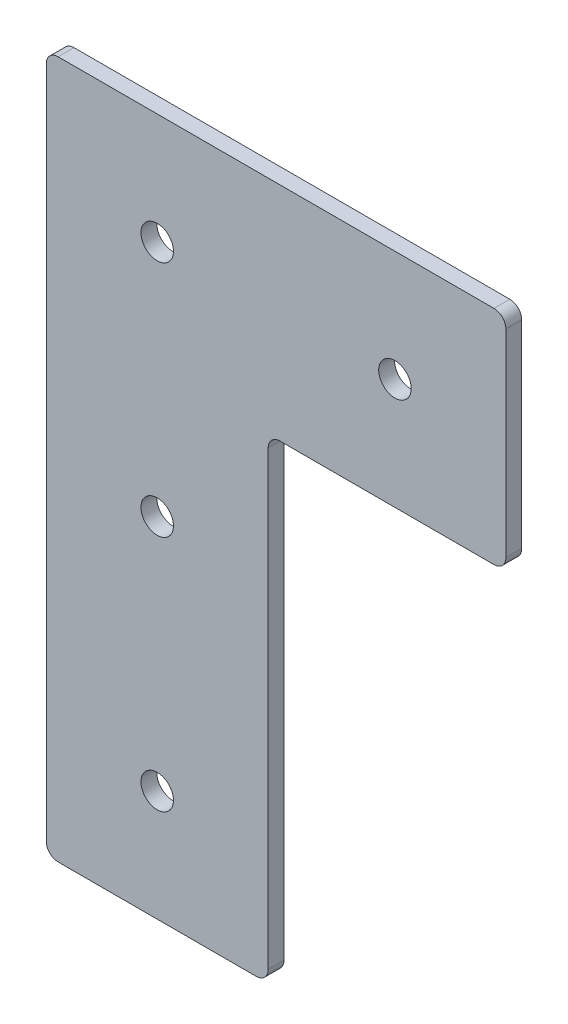
ISO-10303-21;
HEADER;
FILE_DESCRIPTION(('STEP AP214'),'2;1');
FILE_NAME('part.step','',(''),(''),'','','');
FILE_SCHEMA(('AUTOMOTIVE_DESIGN { 1 0 10303 214 1 1 1 1 }'));
ENDSEC;
DATA;
#1=APPLICATION_CONTEXT('core data for automotive mechanical design processes');
#2=APPLICATION_PROTOCOL_DEFINITION('international standard','automotive_design',2000,#1);
#3=PRODUCT_CONTEXT('',#1,'mechanical');
#4=PRODUCT('Part','Part','',(#3));
#5=PRODUCT_RELATED_PRODUCT_CATEGORY('part','',(#4));
#6=PRODUCT_DEFINITION_FORMATION('','',#4);
#7=PRODUCT_DEFINITION_CONTEXT('part definition',#1,'design');
#8=PRODUCT_DEFINITION('design','',#6,#7);
#9=PRODUCT_DEFINITION_SHAPE('','',#8);
#10=(LENGTH_UNIT() NAMED_UNIT(*) SI_UNIT(.MILLI.,.METRE.));
#11=(NAMED_UNIT(*) PLANE_ANGLE_UNIT() SI_UNIT($,.RADIAN.));
#12=(NAMED_UNIT(*) SI_UNIT($,.STERADIAN.) SOLID_ANGLE_UNIT());
#13=UNCERTAINTY_MEASURE_WITH_UNIT(LENGTH_MEASURE(1.E-05),#10,'distance_accuracy_value','');
#14=(GEOMETRIC_REPRESENTATION_CONTEXT(3) GLOBAL_UNCERTAINTY_ASSIGNED_CONTEXT((#13)) GLOBAL_UNIT_ASSIGNED_CONTEXT((#10,
#11,#12)) REPRESENTATION_CONTEXT('',''));
#15=CARTESIAN_POINT('',(0.,0.,0.));
#16=DIRECTION('',(0.,0.,1.));
#17=DIRECTION('',(1.,0.,0.));
#18=AXIS2_PLACEMENT_3D('',#15,#16,#17);
#19=CARTESIAN_POINT('',(0.,0.,4.));
#20=DIRECTION('',(0.,0.,1.));
#21=DIRECTION('',(1.,0.,0.));
#22=AXIS2_PLACEMENT_3D('',#19,#20,#21);
#23=PLANE('',#22);
#24=CARTESIAN_POINT('',(6.24792700594322E-13,-60.,4.));
#25=DIRECTION('',(0.,0.,1.));
#26=DIRECTION('',(1.,0.,0.));
#27=AXIS2_PLACEMENT_3D('',#24,#25,#26);
#28=CIRCLE('',#27,4.1);
#29=CARTESIAN_POINT('',(4.10000000000062,-60.,4.));
#30=VERTEX_POINT('',#29);
#31=EDGE_CURVE('E225',#30,#30,#28,.T.);
#32=ORIENTED_EDGE('',*,*,#31,.F.);
#33=EDGE_LOOP('',(#32));
#34=FACE_BOUND('',#33,.T.);
#35=CARTESIAN_POINT('',(0.,0.,4.));
#36=DIRECTION('',(0.,0.,1.));
#37=DIRECTION('',(1.,0.,0.));
#38=AXIS2_PLACEMENT_3D('',#35,#36,#37);
#39=CIRCLE('',#38,4.1);
#40=CARTESIAN_POINT('',(4.1,0.,4.));
#41=VERTEX_POINT('',#40);
#42=EDGE_CURVE('E133',#41,#41,#39,.T.);
#43=ORIENTED_EDGE('',*,*,#42,.F.);
#44=EDGE_LOOP('',(#43));
#45=FACE_BOUND('',#44,.T.);
#46=DIRECTION('',(-1.,0.,0.));
#47=VECTOR('',#46,1.);
#48=CARTESIAN_POINT('',(-28.,28.,4.));
#49=LINE('',#48,#47);
#50=CARTESIAN_POINT('',(85.,28.,4.));
#51=VERTEX_POINT('',#50);
#52=CARTESIAN_POINT('',(-25.,28.,4.));
#53=VERTEX_POINT('',#52);
#54=EDGE_CURVE('E142',#51,#53,#49,.T.);
#55=ORIENTED_EDGE('',*,*,#54,.T.);
#56=CARTESIAN_POINT('',(-25.,25.,4.));
#57=DIRECTION('',(0.,0.,1.));
#58=DIRECTION('',(1.,0.,0.));
#59=AXIS2_PLACEMENT_3D('',#56,#57,#58);
#60=CIRCLE('',#59,3.);
#61=CARTESIAN_POINT('',(-28.,25.,4.));
#62=VERTEX_POINT('',#61);
#63=EDGE_CURVE('E171',#53,#62,#60,.T.);
#64=ORIENTED_EDGE('',*,*,#63,.T.);
#65=DIRECTION('',(0.,-1.,0.));
#66=VECTOR('',#65,1.);
#67=CARTESIAN_POINT('',(-28.,28.,4.));
#68=LINE('',#67,#66);
#69=CARTESIAN_POINT('',(-28.,-145.,4.));
#70=VERTEX_POINT('',#69);
#71=EDGE_CURVE('E125',#62,#70,#68,.T.);
#72=ORIENTED_EDGE('',*,*,#71,.T.);
#73=CARTESIAN_POINT('',(-25.,-145.,4.));
#74=DIRECTION('',(0.,0.,1.));
#75=DIRECTION('',(1.,0.,0.));
#76=AXIS2_PLACEMENT_3D('',#73,#74,#75);
#77=CIRCLE('',#76,3.);
#78=CARTESIAN_POINT('',(-25.,-148.,4.));
#79=VERTEX_POINT('',#78);
#80=EDGE_CURVE('E169',#70,#79,#77,.T.);
#81=ORIENTED_EDGE('',*,*,#80,.T.);
#82=DIRECTION('',(1.,0.,0.));
#83=VECTOR('',#82,1.);
#84=CARTESIAN_POINT('',(-28.,-148.,4.));
#85=LINE('',#84,#83);
#86=CARTESIAN_POINT('',(25.,-148.,4.));
#87=VERTEX_POINT('',#86);
#88=EDGE_CURVE('E213',#79,#87,#85,.T.);
#89=ORIENTED_EDGE('',*,*,#88,.T.);
#90=CARTESIAN_POINT('',(25.,-145.,4.));
#91=DIRECTION('',(0.,0.,1.));
#92=DIRECTION('',(1.,0.,0.));
#93=AXIS2_PLACEMENT_3D('',#90,#91,#92);
#94=CIRCLE('',#93,3.);
#95=CARTESIAN_POINT('',(28.,-145.,4.));
#96=VERTEX_POINT('',#95);
#97=EDGE_CURVE('E167',#87,#96,#94,.T.);
#98=ORIENTED_EDGE('',*,*,#97,.T.);
#99=DIRECTION('',(0.,1.,0.));
#100=VECTOR('',#99,1.);
#101=CARTESIAN_POINT('',(28.,-28.,4.));
#102=LINE('',#101,#100);
#103=CARTESIAN_POINT('',(28.,-31.,4.));
#104=VERTEX_POINT('',#103);
#105=EDGE_CURVE('E207',#96,#104,#102,.T.);
#106=ORIENTED_EDGE('',*,*,#105,.T.);
#107=CARTESIAN_POINT('',(31.,-31.,4.));
#108=DIRECTION('',(0.,0.,1.));
#109=DIRECTION('',(1.,0.,0.));
#110=AXIS2_PLACEMENT_3D('',#107,#108,#109);
#111=CIRCLE('',#110,3.);
#112=CARTESIAN_POINT('',(31.,-28.,4.));
#113=VERTEX_POINT('',#112);
#114=EDGE_CURVE('E9',#104,#113,#111,.F.);
#115=ORIENTED_EDGE('',*,*,#114,.T.);
#116=DIRECTION('',(1.,0.,0.));
#117=VECTOR('',#116,1.);
#118=CARTESIAN_POINT('',(28.,-28.,4.));
#119=LINE('',#118,#117);
#120=CARTESIAN_POINT('',(85.,-28.,4.));
#121=VERTEX_POINT('',#120);
#122=EDGE_CURVE('E206',#113,#121,#119,.T.);
#123=ORIENTED_EDGE('',*,*,#122,.T.);
#124=CARTESIAN_POINT('',(85.,-25.,4.));
#125=DIRECTION('',(0.,0.,1.));
#126=DIRECTION('',(1.,0.,0.));
#127=AXIS2_PLACEMENT_3D('',#124,#125,#126);
#128=CIRCLE('',#127,3.);
#129=CARTESIAN_POINT('',(88.,-25.,4.));
#130=VERTEX_POINT('',#129);
#131=EDGE_CURVE('E37',#121,#130,#128,.T.);
#132=ORIENTED_EDGE('',*,*,#131,.T.);
#133=DIRECTION('',(0.,1.,0.));
#134=VECTOR('',#133,1.);
#135=CARTESIAN_POINT('',(88.,28.,4.));
#136=LINE('',#135,#134);
#137=CARTESIAN_POINT('',(88.,25.,4.));
#138=VERTEX_POINT('',#137);
#139=EDGE_CURVE('E211',#130,#138,#136,.T.);
#140=ORIENTED_EDGE('',*,*,#139,.T.);
#141=CARTESIAN_POINT('',(85.,25.,4.));
#142=DIRECTION('',(0.,0.,1.));
#143=DIRECTION('',(1.,0.,0.));
#144=AXIS2_PLACEMENT_3D('',#141,#142,#143);
#145=CIRCLE('',#144,3.);
#146=EDGE_CURVE('E165',#138,#51,#145,.T.);
#147=ORIENTED_EDGE('',*,*,#146,.T.);
#148=EDGE_LOOP('',(#55,#64,#72,#81,#89,#98,#106,#115,#123,#132,#140,#147));
#149=FACE_BOUND('',#148,.T.);
#150=CARTESIAN_POINT('',(60.,0.,4.));
#151=DIRECTION('',(0.,0.,1.));
#152=DIRECTION('',(1.,0.,0.));
#153=AXIS2_PLACEMENT_3D('',#150,#151,#152);
#154=CIRCLE('',#153,4.09999999999999);
#155=CARTESIAN_POINT('',(64.1,0.,4.));
#156=VERTEX_POINT('',#155);
#157=EDGE_CURVE('E220',#156,#156,#154,.T.);
#158=ORIENTED_EDGE('',*,*,#157,.F.);
#159=EDGE_LOOP('',(#158));
#160=FACE_BOUND('',#159,.T.);
#161=CARTESIAN_POINT('',(1.24958540118864E-12,-120.,4.));
#162=DIRECTION('',(0.,0.,1.));
#163=DIRECTION('',(1.,0.,0.));
#164=AXIS2_PLACEMENT_3D('',#161,#162,#163);
#165=CIRCLE('',#164,4.1);
#166=CARTESIAN_POINT('',(4.10000000000125,-120.,4.));
#167=VERTEX_POINT('',#166);
#168=EDGE_CURVE('E231',#167,#167,#165,.T.);
#169=ORIENTED_EDGE('',*,*,#168,.F.);
#170=EDGE_LOOP('',(#169));
#171=FACE_BOUND('',#170,.T.);
#172=ADVANCED_FACE('F15',(#34,#45,#149,#160,#171),#23,.T.);
#173=CARTESIAN_POINT('',(0.,0.,0.));
#174=DIRECTION('',(0.,0.,1.));
#175=DIRECTION('',(1.,0.,0.));
#176=AXIS2_PLACEMENT_3D('',#173,#174,#175);
#177=PLANE('',#176);
#178=DIRECTION('',(0.,-1.,0.));
#179=VECTOR('',#178,1.);
#180=CARTESIAN_POINT('',(-28.,-28.,0.));
#181=LINE('',#180,#179);
#182=CARTESIAN_POINT('',(-28.,25.,0.));
#183=VERTEX_POINT('',#182);
#184=CARTESIAN_POINT('',(-28.,-145.,0.));
#185=VERTEX_POINT('',#184);
#186=EDGE_CURVE('E122',#183,#185,#181,.T.);
#187=ORIENTED_EDGE('',*,*,#186,.F.);
#188=CARTESIAN_POINT('',(-25.,25.,0.));
#189=DIRECTION('',(0.,0.,1.));
#190=DIRECTION('',(1.,0.,0.));
#191=AXIS2_PLACEMENT_3D('',#188,#189,#190);
#192=CIRCLE('',#191,3.);
#193=CARTESIAN_POINT('',(-25.,28.,0.));
#194=VERTEX_POINT('',#193);
#195=EDGE_CURVE('E105',#183,#194,#192,.F.);
#196=ORIENTED_EDGE('',*,*,#195,.T.);
#197=DIRECTION('',(-1.,0.,0.));
#198=VECTOR('',#197,1.);
#199=CARTESIAN_POINT('',(-28.,28.,0.));
#200=LINE('',#199,#198);
#201=CARTESIAN_POINT('',(85.,28.,0.));
#202=VERTEX_POINT('',#201);
#203=EDGE_CURVE('E152',#202,#194,#200,.T.);
#204=ORIENTED_EDGE('',*,*,#203,.F.);
#205=CARTESIAN_POINT('',(85.,25.,0.));
#206=DIRECTION('',(0.,0.,1.));
#207=DIRECTION('',(1.,0.,0.));
#208=AXIS2_PLACEMENT_3D('',#205,#206,#207);
#209=CIRCLE('',#208,3.);
#210=CARTESIAN_POINT('',(88.,25.,0.));
#211=VERTEX_POINT('',#210);
#212=EDGE_CURVE('E156',#202,#211,#209,.F.);
#213=ORIENTED_EDGE('',*,*,#212,.T.);
#214=DIRECTION('',(0.,1.,0.));
#215=VECTOR('',#214,1.);
#216=CARTESIAN_POINT('',(88.,28.,0.));
#217=LINE('',#216,#215);
#218=CARTESIAN_POINT('',(88.,-25.,0.));
#219=VERTEX_POINT('',#218);
#220=EDGE_CURVE('E150',#219,#211,#217,.T.);
#221=ORIENTED_EDGE('',*,*,#220,.F.);
#222=CARTESIAN_POINT('',(85.,-25.,0.));
#223=DIRECTION('',(0.,0.,1.));
#224=DIRECTION('',(1.,0.,0.));
#225=AXIS2_PLACEMENT_3D('',#222,#223,#224);
#226=CIRCLE('',#225,3.);
#227=CARTESIAN_POINT('',(85.,-28.,0.));
#228=VERTEX_POINT('',#227);
#229=EDGE_CURVE('E126',#219,#228,#226,.F.);
#230=ORIENTED_EDGE('',*,*,#229,.T.);
#231=DIRECTION('',(1.,0.,0.));
#232=VECTOR('',#231,1.);
#233=CARTESIAN_POINT('',(28.,-28.,0.));
#234=LINE('',#233,#232);
#235=CARTESIAN_POINT('',(31.,-28.,0.));
#236=VERTEX_POINT('',#235);
#237=EDGE_CURVE('E147',#236,#228,#234,.T.);
#238=ORIENTED_EDGE('',*,*,#237,.F.);
#239=CARTESIAN_POINT('',(31.,-31.,0.));
#240=DIRECTION('',(0.,0.,1.));
#241=DIRECTION('',(1.,0.,0.));
#242=AXIS2_PLACEMENT_3D('',#239,#240,#241);
#243=CIRCLE('',#242,3.);
#244=CARTESIAN_POINT('',(28.,-31.,0.));
#245=VERTEX_POINT('',#244);
#246=EDGE_CURVE('E23',#236,#245,#243,.T.);
#247=ORIENTED_EDGE('',*,*,#246,.T.);
#248=DIRECTION('',(0.,1.,0.));
#249=VECTOR('',#248,1.);
#250=CARTESIAN_POINT('',(28.,-28.,0.));
#251=LINE('',#250,#249);
#252=CARTESIAN_POINT('',(28.,-145.,0.));
#253=VERTEX_POINT('',#252);
#254=EDGE_CURVE('E136',#253,#245,#251,.T.);
#255=ORIENTED_EDGE('',*,*,#254,.F.);
#256=CARTESIAN_POINT('',(25.,-145.,0.));
#257=DIRECTION('',(0.,0.,1.));
#258=DIRECTION('',(1.,0.,0.));
#259=AXIS2_PLACEMENT_3D('',#256,#257,#258);
#260=CIRCLE('',#259,3.);
#261=CARTESIAN_POINT('',(25.,-148.,0.));
#262=VERTEX_POINT('',#261);
#263=EDGE_CURVE('E158',#253,#262,#260,.F.);
#264=ORIENTED_EDGE('',*,*,#263,.T.);
#265=DIRECTION('',(1.,0.,0.));
#266=VECTOR('',#265,1.);
#267=CARTESIAN_POINT('',(-28.,-148.,0.));
#268=LINE('',#267,#266);
#269=CARTESIAN_POINT('',(-25.,-148.,0.));
#270=VERTEX_POINT('',#269);
#271=EDGE_CURVE('E132',#270,#262,#268,.T.);
#272=ORIENTED_EDGE('',*,*,#271,.F.);
#273=CARTESIAN_POINT('',(-25.,-145.,0.));
#274=DIRECTION('',(0.,0.,1.));
#275=DIRECTION('',(1.,0.,0.));
#276=AXIS2_PLACEMENT_3D('',#273,#274,#275);
#277=CIRCLE('',#276,3.);
#278=EDGE_CURVE('E116',#270,#185,#277,.F.);
#279=ORIENTED_EDGE('',*,*,#278,.T.);
#280=EDGE_LOOP('',(#187,#196,#204,#213,#221,#230,#238,#247,#255,#264,#272,#279));
#281=FACE_BOUND('',#280,.T.);
#282=CARTESIAN_POINT('',(0.,0.,0.));
#283=DIRECTION('',(0.,0.,1.));
#284=DIRECTION('',(1.,0.,0.));
#285=AXIS2_PLACEMENT_3D('',#282,#283,#284);
#286=CIRCLE('',#285,4.1);
#287=CARTESIAN_POINT('',(4.1,0.,0.));
#288=VERTEX_POINT('',#287);
#289=EDGE_CURVE('E139',#288,#288,#286,.T.);
#290=ORIENTED_EDGE('',*,*,#289,.T.);
#291=EDGE_LOOP('',(#290));
#292=FACE_BOUND('',#291,.T.);
#293=CARTESIAN_POINT('',(60.,0.,0.));
#294=DIRECTION('',(0.,0.,1.));
#295=DIRECTION('',(1.,0.,0.));
#296=AXIS2_PLACEMENT_3D('',#293,#294,#295);
#297=CIRCLE('',#296,4.09999999999999);
#298=CARTESIAN_POINT('',(64.1,0.,0.));
#299=VERTEX_POINT('',#298);
#300=EDGE_CURVE('E222',#299,#299,#297,.T.);
#301=ORIENTED_EDGE('',*,*,#300,.T.);
#302=EDGE_LOOP('',(#301));
#303=FACE_BOUND('',#302,.T.);
#304=CARTESIAN_POINT('',(6.24792700594322E-13,-60.,0.));
#305=DIRECTION('',(0.,0.,1.));
#306=DIRECTION('',(1.,0.,0.));
#307=AXIS2_PLACEMENT_3D('',#304,#305,#306);
#308=CIRCLE('',#307,4.1);
#309=CARTESIAN_POINT('',(4.10000000000062,-60.,0.));
#310=VERTEX_POINT('',#309);
#311=EDGE_CURVE('E228',#310,#310,#308,.T.);
#312=ORIENTED_EDGE('',*,*,#311,.T.);
#313=EDGE_LOOP('',(#312));
#314=FACE_BOUND('',#313,.T.);
#315=CARTESIAN_POINT('',(1.24958540118864E-12,-120.,0.));
#316=DIRECTION('',(0.,0.,1.));
#317=DIRECTION('',(1.,0.,0.));
#318=AXIS2_PLACEMENT_3D('',#315,#316,#317);
#319=CIRCLE('',#318,4.1);
#320=CARTESIAN_POINT('',(4.10000000000125,-120.,0.));
#321=VERTEX_POINT('',#320);
#322=EDGE_CURVE('E234',#321,#321,#319,.T.);
#323=ORIENTED_EDGE('',*,*,#322,.T.);
#324=EDGE_LOOP('',(#323));
#325=FACE_BOUND('',#324,.T.);
#326=ADVANCED_FACE('F129',(#281,#292,#303,#314,#325),#177,.F.);
#327=CARTESIAN_POINT('',(-28.,-28.,4.));
#328=DIRECTION('',(1.,0.,0.));
#329=DIRECTION('',(0.,1.,0.));
#330=AXIS2_PLACEMENT_3D('',#327,#328,#329);
#331=PLANE('',#330);
#332=ORIENTED_EDGE('',*,*,#71,.F.);
#333=DIRECTION('',(0.,0.,-1.));
#334=VECTOR('',#333,1.);
#335=CARTESIAN_POINT('',(-28.,25.,4.));
#336=LINE('',#335,#334);
#337=EDGE_CURVE('E109',#62,#183,#336,.T.);
#338=ORIENTED_EDGE('',*,*,#337,.T.);
#339=ORIENTED_EDGE('',*,*,#186,.T.);
#340=DIRECTION('',(0.,0.,-1.));
#341=VECTOR('',#340,1.);
#342=CARTESIAN_POINT('',(-28.,-145.,4.));
#343=LINE('',#342,#341);
#344=EDGE_CURVE('E127',#185,#70,#343,.F.);
#345=ORIENTED_EDGE('',*,*,#344,.T.);
#346=EDGE_LOOP('',(#332,#338,#339,#345));
#347=FACE_BOUND('',#346,.T.);
#348=ADVANCED_FACE('F121',(#347),#331,.F.);
#349=CARTESIAN_POINT('',(-28.,-148.,4.));
#350=DIRECTION('',(0.,1.,0.));
#351=DIRECTION('',(0.,0.,1.));
#352=AXIS2_PLACEMENT_3D('',#349,#350,#351);
#353=PLANE('',#352);
#354=ORIENTED_EDGE('',*,*,#88,.F.);
#355=DIRECTION('',(0.,0.,-1.));
#356=VECTOR('',#355,1.);
#357=CARTESIAN_POINT('',(-25.,-148.,4.));
#358=LINE('',#357,#356);
#359=EDGE_CURVE('E175',#79,#270,#358,.T.);
#360=ORIENTED_EDGE('',*,*,#359,.T.);
#361=ORIENTED_EDGE('',*,*,#271,.T.);
#362=DIRECTION('',(0.,0.,-1.));
#363=VECTOR('',#362,1.);
#364=CARTESIAN_POINT('',(25.,-148.,4.));
#365=LINE('',#364,#363);
#366=EDGE_CURVE('E173',#262,#87,#365,.F.);
#367=ORIENTED_EDGE('',*,*,#366,.T.);
#368=EDGE_LOOP('',(#354,#360,#361,#367));
#369=FACE_BOUND('',#368,.T.);
#370=ADVANCED_FACE('F268',(#369),#353,.F.);
#371=CARTESIAN_POINT('',(28.,-28.,4.));
#372=DIRECTION('',(-1.,0.,0.));
#373=DIRECTION('',(0.,-1.,0.));
#374=AXIS2_PLACEMENT_3D('',#371,#372,#373);
#375=PLANE('',#374);
#376=ORIENTED_EDGE('',*,*,#105,.F.);
#377=DIRECTION('',(0.,0.,-1.));
#378=VECTOR('',#377,1.);
#379=CARTESIAN_POINT('',(28.,-145.,4.));
#380=LINE('',#379,#378);
#381=EDGE_CURVE('E180',#96,#253,#380,.T.);
#382=ORIENTED_EDGE('',*,*,#381,.T.);
#383=ORIENTED_EDGE('',*,*,#254,.T.);
#384=DIRECTION('',(0.,0.,-1.));
#385=VECTOR('',#384,1.);
#386=CARTESIAN_POINT('',(28.,-31.,4.));
#387=LINE('',#386,#385);
#388=EDGE_CURVE('E178',#245,#104,#387,.F.);
#389=ORIENTED_EDGE('',*,*,#388,.T.);
#390=EDGE_LOOP('',(#376,#382,#383,#389));
#391=FACE_BOUND('',#390,.T.);
#392=ADVANCED_FACE('F198',(#391),#375,.F.);
#393=CARTESIAN_POINT('',(28.,-28.,4.));
#394=DIRECTION('',(0.,1.,0.));
#395=DIRECTION('',(-1.,0.,0.));
#396=AXIS2_PLACEMENT_3D('',#393,#394,#395);
#397=PLANE('',#396);
#398=ORIENTED_EDGE('',*,*,#122,.F.);
#399=DIRECTION('',(0.,0.,-1.));
#400=VECTOR('',#399,1.);
#401=CARTESIAN_POINT('',(31.,-28.,0.));
#402=LINE('',#401,#400);
#403=EDGE_CURVE('E185',#113,#236,#402,.T.);
#404=ORIENTED_EDGE('',*,*,#403,.T.);
#405=ORIENTED_EDGE('',*,*,#237,.T.);
#406=DIRECTION('',(0.,0.,-1.));
#407=VECTOR('',#406,1.);
#408=CARTESIAN_POINT('',(85.,-28.,4.));
#409=LINE('',#408,#407);
#410=EDGE_CURVE('E183',#228,#121,#409,.F.);
#411=ORIENTED_EDGE('',*,*,#410,.T.);
#412=EDGE_LOOP('',(#398,#404,#405,#411));
#413=FACE_BOUND('',#412,.T.);
#414=ADVANCED_FACE('F209',(#413),#397,.F.);
#415=CARTESIAN_POINT('',(88.,28.,4.));
#416=DIRECTION('',(-1.,0.,0.));
#417=DIRECTION('',(0.,0.,1.));
#418=AXIS2_PLACEMENT_3D('',#415,#416,#417);
#419=PLANE('',#418);
#420=ORIENTED_EDGE('',*,*,#220,.T.);
#421=DIRECTION('',(0.,0.,-1.));
#422=VECTOR('',#421,1.);
#423=CARTESIAN_POINT('',(88.,25.,4.));
#424=LINE('',#423,#422);
#425=EDGE_CURVE('E30',#211,#138,#424,.F.);
#426=ORIENTED_EDGE('',*,*,#425,.T.);
#427=ORIENTED_EDGE('',*,*,#139,.F.);
#428=DIRECTION('',(0.,0.,-1.));
#429=VECTOR('',#428,1.);
#430=CARTESIAN_POINT('',(88.,-25.,4.));
#431=LINE('',#430,#429);
#432=EDGE_CURVE('E188',#130,#219,#431,.T.);
#433=ORIENTED_EDGE('',*,*,#432,.T.);
#434=EDGE_LOOP('',(#420,#426,#427,#433));
#435=FACE_BOUND('',#434,.T.);
#436=ADVANCED_FACE('F260',(#435),#419,.F.);
#437=CARTESIAN_POINT('',(-28.,28.,4.));
#438=DIRECTION('',(0.,-1.,0.));
#439=DIRECTION('',(1.,0.,0.));
#440=AXIS2_PLACEMENT_3D('',#437,#438,#439);
#441=PLANE('',#440);
#442=ORIENTED_EDGE('',*,*,#203,.T.);
#443=DIRECTION('',(0.,0.,-1.));
#444=VECTOR('',#443,1.);
#445=CARTESIAN_POINT('',(-25.,28.,4.));
#446=LINE('',#445,#444);
#447=EDGE_CURVE('E110',#194,#53,#446,.F.);
#448=ORIENTED_EDGE('',*,*,#447,.T.);
#449=ORIENTED_EDGE('',*,*,#54,.F.);
#450=DIRECTION('',(0.,0.,-1.));
#451=VECTOR('',#450,1.);
#452=CARTESIAN_POINT('',(85.,28.,4.));
#453=LINE('',#452,#451);
#454=EDGE_CURVE('E115',#51,#202,#453,.T.);
#455=ORIENTED_EDGE('',*,*,#454,.T.);
#456=EDGE_LOOP('',(#442,#448,#449,#455));
#457=FACE_BOUND('',#456,.T.);
#458=ADVANCED_FACE('F257',(#457),#441,.F.);
#459=CARTESIAN_POINT('',(0.,0.,4.));
#460=DIRECTION('',(0.,0.,-1.));
#461=DIRECTION('',(-1.,0.,0.));
#462=AXIS2_PLACEMENT_3D('',#459,#460,#461);
#463=CYLINDRICAL_SURFACE('',#462,4.1);
#464=ORIENTED_EDGE('',*,*,#42,.T.);
#465=EDGE_LOOP('',(#464));
#466=FACE_BOUND('',#465,.T.);
#467=ORIENTED_EDGE('',*,*,#289,.F.);
#468=EDGE_LOOP('',(#467));
#469=FACE_BOUND('',#468,.T.);
#470=ADVANCED_FACE('F254',(#466,#469),#463,.F.);
#471=CARTESIAN_POINT('',(60.,0.,4.));
#472=DIRECTION('',(0.,0.,-1.));
#473=DIRECTION('',(-1.,0.,0.));
#474=AXIS2_PLACEMENT_3D('',#471,#472,#473);
#475=CYLINDRICAL_SURFACE('',#474,4.09999999999999);
#476=ORIENTED_EDGE('',*,*,#157,.T.);
#477=EDGE_LOOP('',(#476));
#478=FACE_BOUND('',#477,.T.);
#479=ORIENTED_EDGE('',*,*,#300,.F.);
#480=EDGE_LOOP('',(#479));
#481=FACE_BOUND('',#480,.T.);
#482=ADVANCED_FACE('F357',(#478,#481),#475,.F.);
#483=CARTESIAN_POINT('',(6.24792700594322E-13,-60.,4.));
#484=DIRECTION('',(0.,0.,-1.));
#485=DIRECTION('',(-1.,0.,0.));
#486=AXIS2_PLACEMENT_3D('',#483,#484,#485);
#487=CYLINDRICAL_SURFACE('',#486,4.1);
#488=ORIENTED_EDGE('',*,*,#31,.T.);
#489=EDGE_LOOP('',(#488));
#490=FACE_BOUND('',#489,.T.);
#491=ORIENTED_EDGE('',*,*,#311,.F.);
#492=EDGE_LOOP('',(#491));
#493=FACE_BOUND('',#492,.T.);
#494=ADVANCED_FACE('F348',(#490,#493),#487,.F.);
#495=CARTESIAN_POINT('',(1.24958540118864E-12,-120.,4.));
#496=DIRECTION('',(0.,0.,-1.));
#497=DIRECTION('',(-1.,0.,0.));
#498=AXIS2_PLACEMENT_3D('',#495,#496,#497);
#499=CYLINDRICAL_SURFACE('',#498,4.1);
#500=ORIENTED_EDGE('',*,*,#168,.T.);
#501=EDGE_LOOP('',(#500));
#502=FACE_BOUND('',#501,.T.);
#503=ORIENTED_EDGE('',*,*,#322,.F.);
#504=EDGE_LOOP('',(#503));
#505=FACE_BOUND('',#504,.T.);
#506=ADVANCED_FACE('F240',(#502,#505),#499,.F.);
#507=CARTESIAN_POINT('',(-25.,25.,4.));
#508=DIRECTION('',(0.,0.,-1.));
#509=DIRECTION('',(-1.,0.,0.));
#510=AXIS2_PLACEMENT_3D('',#507,#508,#509);
#511=CYLINDRICAL_SURFACE('',#510,3.);
#512=ORIENTED_EDGE('',*,*,#63,.F.);
#513=ORIENTED_EDGE('',*,*,#447,.F.);
#514=ORIENTED_EDGE('',*,*,#195,.F.);
#515=ORIENTED_EDGE('',*,*,#337,.F.);
#516=EDGE_LOOP('',(#512,#513,#514,#515));
#517=FACE_BOUND('',#516,.T.);
#518=ADVANCED_FACE('F108',(#517),#511,.T.);
#519=CARTESIAN_POINT('',(-25.,-145.,4.));
#520=DIRECTION('',(0.,0.,-1.));
#521=DIRECTION('',(-1.,0.,0.));
#522=AXIS2_PLACEMENT_3D('',#519,#520,#521);
#523=CYLINDRICAL_SURFACE('',#522,3.);
#524=ORIENTED_EDGE('',*,*,#80,.F.);
#525=ORIENTED_EDGE('',*,*,#344,.F.);
#526=ORIENTED_EDGE('',*,*,#278,.F.);
#527=ORIENTED_EDGE('',*,*,#359,.F.);
#528=EDGE_LOOP('',(#524,#525,#526,#527));
#529=FACE_BOUND('',#528,.T.);
#530=ADVANCED_FACE('F276',(#529),#523,.T.);
#531=CARTESIAN_POINT('',(25.,-145.,4.));
#532=DIRECTION('',(0.,0.,-1.));
#533=DIRECTION('',(-1.,0.,0.));
#534=AXIS2_PLACEMENT_3D('',#531,#532,#533);
#535=CYLINDRICAL_SURFACE('',#534,3.);
#536=ORIENTED_EDGE('',*,*,#97,.F.);
#537=ORIENTED_EDGE('',*,*,#366,.F.);
#538=ORIENTED_EDGE('',*,*,#263,.F.);
#539=ORIENTED_EDGE('',*,*,#381,.F.);
#540=EDGE_LOOP('',(#536,#537,#538,#539));
#541=FACE_BOUND('',#540,.T.);
#542=ADVANCED_FACE('F279',(#541),#535,.T.);
#543=CARTESIAN_POINT('',(31.,-31.,4.));
#544=DIRECTION('',(0.,0.,1.));
#545=DIRECTION('',(1.,0.,0.));
#546=AXIS2_PLACEMENT_3D('',#543,#544,#545);
#547=CYLINDRICAL_SURFACE('',#546,3.);
#548=ORIENTED_EDGE('',*,*,#114,.F.);
#549=ORIENTED_EDGE('',*,*,#388,.F.);
#550=ORIENTED_EDGE('',*,*,#246,.F.);
#551=ORIENTED_EDGE('',*,*,#403,.F.);
#552=EDGE_LOOP('',(#548,#549,#550,#551));
#553=FACE_BOUND('',#552,.T.);
#554=ADVANCED_FACE('F202',(#553),#547,.F.);
#555=CARTESIAN_POINT('',(85.,25.,4.));
#556=DIRECTION('',(0.,0.,-1.));
#557=DIRECTION('',(-1.,0.,0.));
#558=AXIS2_PLACEMENT_3D('',#555,#556,#557);
#559=CYLINDRICAL_SURFACE('',#558,3.);
#560=ORIENTED_EDGE('',*,*,#146,.F.);
#561=ORIENTED_EDGE('',*,*,#425,.F.);
#562=ORIENTED_EDGE('',*,*,#212,.F.);
#563=ORIENTED_EDGE('',*,*,#454,.F.);
#564=EDGE_LOOP('',(#560,#561,#562,#563));
#565=FACE_BOUND('',#564,.T.);
#566=ADVANCED_FACE('F285',(#565),#559,.T.);
#567=CARTESIAN_POINT('',(85.,-25.,4.));
#568=DIRECTION('',(0.,0.,-1.));
#569=DIRECTION('',(-1.,0.,0.));
#570=AXIS2_PLACEMENT_3D('',#567,#568,#569);
#571=CYLINDRICAL_SURFACE('',#570,3.);
#572=ORIENTED_EDGE('',*,*,#131,.F.);
#573=ORIENTED_EDGE('',*,*,#410,.F.);
#574=ORIENTED_EDGE('',*,*,#229,.F.);
#575=ORIENTED_EDGE('',*,*,#432,.F.);
#576=EDGE_LOOP('',(#572,#573,#574,#575));
#577=FACE_BOUND('',#576,.T.);
#578=ADVANCED_FACE('F17',(#577),#571,.T.);
#579=CLOSED_SHELL('',(#172,#326,#348,#370,#392,#414,#436,#458,#470,#482,#494,#506,#518,#530,
#542,#554,#566,#578));
#580=MANIFOLD_SOLID_BREP('B1',#579);
#581=ADVANCED_BREP_SHAPE_REPRESENTATION('',(#18,#580),#14);
#582=SHAPE_DEFINITION_REPRESENTATION(#9,#581);
ENDSEC;
END-ISO-10303-21;
